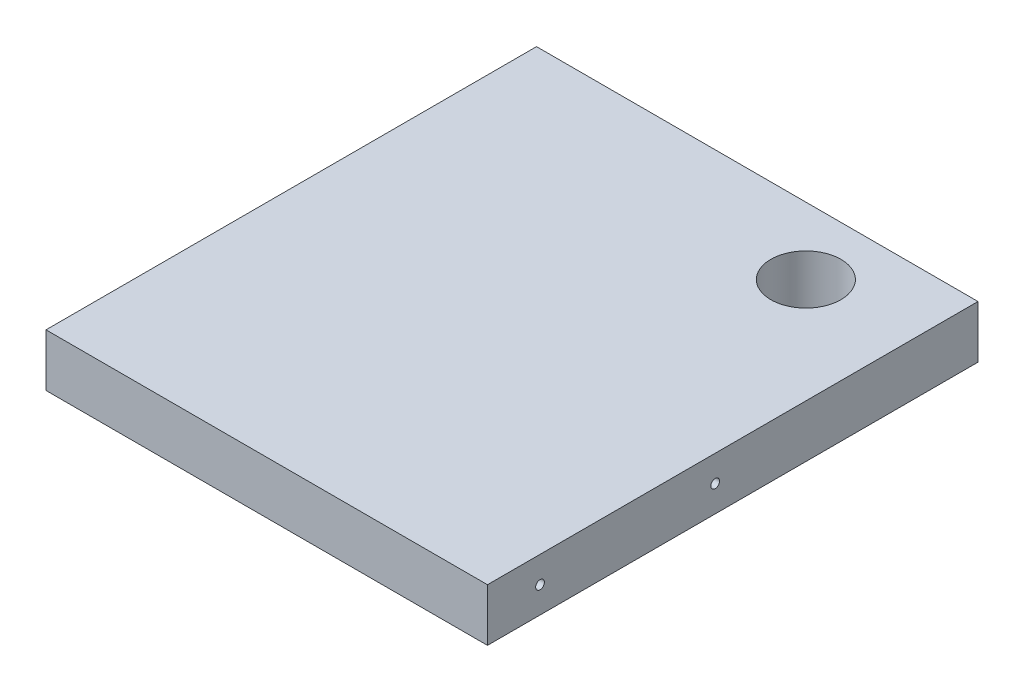
ISO-10303-21;
HEADER;
FILE_DESCRIPTION(('STEP AP214'),'2;1');
FILE_NAME('part.step','',(''),(''),'','','');
FILE_SCHEMA(('AUTOMOTIVE_DESIGN { 1 0 10303 214 1 1 1 1 }'));
ENDSEC;
DATA;
#1=APPLICATION_CONTEXT('core data for automotive mechanical design processes');
#2=APPLICATION_PROTOCOL_DEFINITION('international standard','automotive_design',2000,#1);
#3=PRODUCT_CONTEXT('',#1,'mechanical');
#4=PRODUCT('Part','Part','',(#3));
#5=PRODUCT_RELATED_PRODUCT_CATEGORY('part','',(#4));
#6=PRODUCT_DEFINITION_FORMATION('','',#4);
#7=PRODUCT_DEFINITION_CONTEXT('part definition',#1,'design');
#8=PRODUCT_DEFINITION('design','',#6,#7);
#9=PRODUCT_DEFINITION_SHAPE('','',#8);
#10=(LENGTH_UNIT() NAMED_UNIT(*) SI_UNIT(.MILLI.,.METRE.));
#11=(NAMED_UNIT(*) PLANE_ANGLE_UNIT() SI_UNIT($,.RADIAN.));
#12=(NAMED_UNIT(*) SI_UNIT($,.STERADIAN.) SOLID_ANGLE_UNIT());
#13=UNCERTAINTY_MEASURE_WITH_UNIT(LENGTH_MEASURE(1.E-05),#10,'distance_accuracy_value','');
#14=(GEOMETRIC_REPRESENTATION_CONTEXT(3) GLOBAL_UNCERTAINTY_ASSIGNED_CONTEXT((#13)) GLOBAL_UNIT_ASSIGNED_CONTEXT((#10,
#11,#12)) REPRESENTATION_CONTEXT('',''));
#15=CARTESIAN_POINT('',(0.,0.,0.));
#16=DIRECTION('',(0.,0.,1.));
#17=DIRECTION('',(1.,0.,0.));
#18=AXIS2_PLACEMENT_3D('',#15,#16,#17);
#19=CARTESIAN_POINT('',(0.,0.,0.));
#20=DIRECTION('',(0.,0.,1.));
#21=DIRECTION('',(1.,0.,0.));
#22=AXIS2_PLACEMENT_3D('',#19,#20,#21);
#23=PLANE('',#22);
#24=CARTESIAN_POINT('',(0.,5836.57938054568,0.));
#25=DIRECTION('',(0.,0.,1.));
#26=DIRECTION('',(1.,0.,0.));
#27=AXIS2_PLACEMENT_3D('',#24,#25,#26);
#28=CIRCLE('',#27,0.991870000000001);
#29=CARTESIAN_POINT('',(0.991870000000015,5836.57938054568,0.));
#30=VERTEX_POINT('',#29);
#31=EDGE_CURVE('E125',#30,#30,#28,.T.);
#32=ORIENTED_EDGE('',*,*,#31,.T.);
#33=EDGE_LOOP('',(#32));
#34=FACE_BOUND('',#33,.T.);
#35=CARTESIAN_POINT('',(60.9599999999995,5836.57938054568,0.));
#36=DIRECTION('',(0.,0.,1.));
#37=DIRECTION('',(1.,0.,0.));
#38=AXIS2_PLACEMENT_3D('',#35,#36,#37);
#39=CIRCLE('',#38,0.991870000000002);
#40=CARTESIAN_POINT('',(61.9518699999995,5836.57938054568,0.));
#41=VERTEX_POINT('',#40);
#42=EDGE_CURVE('E129',#41,#41,#39,.T.);
#43=ORIENTED_EDGE('',*,*,#42,.T.);
#44=EDGE_LOOP('',(#43));
#45=FACE_BOUND('',#44,.T.);
#46=CARTESIAN_POINT('',(-60.9599999999995,5836.57938054568,0.));
#47=DIRECTION('',(0.,0.,1.));
#48=DIRECTION('',(1.,0.,0.));
#49=AXIS2_PLACEMENT_3D('',#46,#47,#48);
#50=CIRCLE('',#49,0.991870000000002);
#51=CARTESIAN_POINT('',(-59.9681299999995,5836.57938054568,0.));
#52=VERTEX_POINT('',#51);
#53=EDGE_CURVE('E133',#52,#52,#50,.T.);
#54=ORIENTED_EDGE('',*,*,#53,.T.);
#55=EDGE_LOOP('',(#54));
#56=FACE_BOUND('',#55,.T.);
#57=DIRECTION('',(0.,-1.,0.));
#58=VECTOR('',#57,1.);
#59=CARTESIAN_POINT('',(-80.0099999999995,5846.10438054568,0.));
#60=LINE('',#59,#58);
#61=CARTESIAN_POINT('',(-80.0099999999995,5846.10438054568,0.));
#62=VERTEX_POINT('',#61);
#63=CARTESIAN_POINT('',(-80.0099999999995,5827.05438054568,0.));
#64=VERTEX_POINT('',#63);
#65=EDGE_CURVE('E138',#62,#64,#60,.T.);
#66=ORIENTED_EDGE('',*,*,#65,.F.);
#67=DIRECTION('',(-1.,0.,0.));
#68=VECTOR('',#67,1.);
#69=CARTESIAN_POINT('',(-80.0099999999995,5846.10438054568,0.));
#70=LINE('',#69,#68);
#71=CARTESIAN_POINT('',(80.0099999999995,5846.10438054568,0.));
#72=VERTEX_POINT('',#71);
#73=EDGE_CURVE('E147',#72,#62,#70,.T.);
#74=ORIENTED_EDGE('',*,*,#73,.F.);
#75=DIRECTION('',(0.,1.,0.));
#76=VECTOR('',#75,1.);
#77=CARTESIAN_POINT('',(80.0099999999995,5846.10438054568,0.));
#78=LINE('',#77,#76);
#79=CARTESIAN_POINT('',(80.0099999999995,5827.05438054568,0.));
#80=VERTEX_POINT('',#79);
#81=EDGE_CURVE('E144',#80,#72,#78,.T.);
#82=ORIENTED_EDGE('',*,*,#81,.F.);
#83=DIRECTION('',(1.,0.,0.));
#84=VECTOR('',#83,1.);
#85=CARTESIAN_POINT('',(-80.0099999999995,5827.05438054568,0.));
#86=LINE('',#85,#84);
#87=EDGE_CURVE('E141',#64,#80,#86,.T.);
#88=ORIENTED_EDGE('',*,*,#87,.F.);
#89=EDGE_LOOP('',(#66,#74,#82,#88));
#90=FACE_BOUND('',#89,.T.);
#91=ADVANCED_FACE('F33',(#34,#45,#56,#90),#23,.F.);
#92=CARTESIAN_POINT('',(-80.0099999999995,5846.10438054568,440.54993918708));
#93=DIRECTION('',(0.,-1.,0.));
#94=DIRECTION('',(0.,0.,-1.));
#95=AXIS2_PLACEMENT_3D('',#92,#93,#94);
#96=PLANE('',#95);
#97=CARTESIAN_POINT('',(41.9099999999995,5846.10438054568,24.2951604274264));
#98=DIRECTION('',(0.,-1.,0.));
#99=DIRECTION('',(0.,0.,-1.));
#100=AXIS2_PLACEMENT_3D('',#97,#98,#99);
#101=CIRCLE('',#100,12.7);
#102=CARTESIAN_POINT('',(41.9099999999995,5846.10438054568,11.5951604274264));
#103=VERTEX_POINT('',#102);
#104=EDGE_CURVE('E102',#103,#103,#101,.T.);
#105=ORIENTED_EDGE('',*,*,#104,.T.);
#106=EDGE_LOOP('',(#105));
#107=FACE_BOUND('',#106,.T.);
#108=DIRECTION('',(0.,0.,-1.));
#109=VECTOR('',#108,1.);
#110=CARTESIAN_POINT('',(-80.0099999999995,5846.10438054568,440.54993918708));
#111=LINE('',#110,#109);
#112=CARTESIAN_POINT('',(-80.0099999999995,5846.10438054568,177.799999999999));
#113=VERTEX_POINT('',#112);
#114=EDGE_CURVE('E150',#113,#62,#111,.T.);
#115=ORIENTED_EDGE('',*,*,#114,.F.);
#116=DIRECTION('',(1.,0.,0.));
#117=VECTOR('',#116,1.);
#118=CARTESIAN_POINT('',(-80.0100000000001,5846.10438054568,177.799999999999));
#119=LINE('',#118,#117);
#120=CARTESIAN_POINT('',(80.0099999999995,5846.10438054568,177.799999999999));
#121=VERTEX_POINT('',#120);
#122=EDGE_CURVE('E54',#113,#121,#119,.T.);
#123=ORIENTED_EDGE('',*,*,#122,.T.);
#124=DIRECTION('',(0.,0.,-1.));
#125=VECTOR('',#124,1.);
#126=CARTESIAN_POINT('',(80.0099999999995,5846.10438054568,440.54993918708));
#127=LINE('',#126,#125);
#128=EDGE_CURVE('E152',#121,#72,#127,.T.);
#129=ORIENTED_EDGE('',*,*,#128,.T.);
#130=ORIENTED_EDGE('',*,*,#73,.T.);
#131=EDGE_LOOP('',(#115,#123,#129,#130));
#132=FACE_BOUND('',#131,.T.);
#133=ADVANCED_FACE('F190',(#107,#132),#96,.F.);
#134=CARTESIAN_POINT('',(80.0099999999995,5846.10438054568,440.54993918708));
#135=DIRECTION('',(-1.,0.,0.));
#136=DIRECTION('',(0.,-1.,0.));
#137=AXIS2_PLACEMENT_3D('',#134,#135,#136);
#138=PLANE('',#137);
#139=CARTESIAN_POINT('',(80.0099999999995,5836.57938054568,158.749999999999));
#140=DIRECTION('',(-1.,0.,0.));
#141=DIRECTION('',(0.,-1.,0.));
#142=AXIS2_PLACEMENT_3D('',#139,#140,#141);
#143=CIRCLE('',#142,1.5875000000003);
#144=CARTESIAN_POINT('',(80.0099999999995,5834.99188054568,158.749999999999));
#145=VERTEX_POINT('',#144);
#146=EDGE_CURVE('E117',#145,#145,#143,.T.);
#147=ORIENTED_EDGE('',*,*,#146,.T.);
#148=EDGE_LOOP('',(#147));
#149=FACE_BOUND('',#148,.T.);
#150=CARTESIAN_POINT('',(80.0099999999995,5836.57938054568,95.2500000000001));
#151=DIRECTION('',(-1.,0.,0.));
#152=DIRECTION('',(0.,-1.,0.));
#153=AXIS2_PLACEMENT_3D('',#150,#151,#152);
#154=CIRCLE('',#153,1.5875000000003);
#155=CARTESIAN_POINT('',(80.0099999999995,5834.99188054568,95.2500000000001));
#156=VERTEX_POINT('',#155);
#157=EDGE_CURVE('E121',#156,#156,#154,.T.);
#158=ORIENTED_EDGE('',*,*,#157,.T.);
#159=EDGE_LOOP('',(#158));
#160=FACE_BOUND('',#159,.T.);
#161=ORIENTED_EDGE('',*,*,#128,.F.);
#162=DIRECTION('',(0.,-1.,0.));
#163=VECTOR('',#162,1.);
#164=CARTESIAN_POINT('',(80.0099999999995,5846.10438054568,177.799999999999));
#165=LINE('',#164,#163);
#166=CARTESIAN_POINT('',(80.0099999999995,5827.05438054568,177.799999999999));
#167=VERTEX_POINT('',#166);
#168=EDGE_CURVE('E134',#121,#167,#165,.T.);
#169=ORIENTED_EDGE('',*,*,#168,.T.);
#170=DIRECTION('',(0.,0.,-1.));
#171=VECTOR('',#170,1.);
#172=CARTESIAN_POINT('',(80.0099999999995,5827.05438054568,440.54993918708));
#173=LINE('',#172,#171);
#174=EDGE_CURVE('E154',#167,#80,#173,.T.);
#175=ORIENTED_EDGE('',*,*,#174,.T.);
#176=ORIENTED_EDGE('',*,*,#81,.T.);
#177=EDGE_LOOP('',(#161,#169,#175,#176));
#178=FACE_BOUND('',#177,.T.);
#179=ADVANCED_FACE('F196',(#149,#160,#178),#138,.F.);
#180=CARTESIAN_POINT('',(-80.0099999999995,5827.05438054568,440.54993918708));
#181=DIRECTION('',(0.,1.,0.));
#182=DIRECTION('',(0.,0.,1.));
#183=AXIS2_PLACEMENT_3D('',#180,#181,#182);
#184=PLANE('',#183);
#185=CARTESIAN_POINT('',(41.9099999999995,5827.05438054568,24.2951604274264));
#186=DIRECTION('',(0.,-1.,0.));
#187=DIRECTION('',(0.,0.,-1.));
#188=AXIS2_PLACEMENT_3D('',#185,#186,#187);
#189=CIRCLE('',#188,12.7);
#190=CARTESIAN_POINT('',(41.9099999999995,5827.05438054568,11.5951604274264));
#191=VERTEX_POINT('',#190);
#192=EDGE_CURVE('E107',#191,#191,#189,.T.);
#193=ORIENTED_EDGE('',*,*,#192,.F.);
#194=EDGE_LOOP('',(#193));
#195=FACE_BOUND('',#194,.T.);
#196=ORIENTED_EDGE('',*,*,#174,.F.);
#197=DIRECTION('',(-1.,0.,0.));
#198=VECTOR('',#197,1.);
#199=CARTESIAN_POINT('',(-80.0100000000001,5827.05438054568,177.799999999999));
#200=LINE('',#199,#198);
#201=CARTESIAN_POINT('',(-80.0099999999995,5827.05438054568,177.799999999999));
#202=VERTEX_POINT('',#201);
#203=EDGE_CURVE('E42',#167,#202,#200,.T.);
#204=ORIENTED_EDGE('',*,*,#203,.T.);
#205=DIRECTION('',(0.,0.,-1.));
#206=VECTOR('',#205,1.);
#207=CARTESIAN_POINT('',(-80.0099999999995,5827.05438054568,440.54993918708));
#208=LINE('',#207,#206);
#209=EDGE_CURVE('E156',#202,#64,#208,.T.);
#210=ORIENTED_EDGE('',*,*,#209,.T.);
#211=ORIENTED_EDGE('',*,*,#87,.T.);
#212=EDGE_LOOP('',(#196,#204,#210,#211));
#213=FACE_BOUND('',#212,.T.);
#214=ADVANCED_FACE('F205',(#195,#213),#184,.F.);
#215=CARTESIAN_POINT('',(-80.0099999999995,5846.10438054568,440.54993918708));
#216=DIRECTION('',(1.,0.,0.));
#217=DIRECTION('',(0.,1.,0.));
#218=AXIS2_PLACEMENT_3D('',#215,#216,#217);
#219=PLANE('',#218);
#220=CARTESIAN_POINT('',(-80.0099999999995,5836.57938054568,158.749999999999));
#221=DIRECTION('',(1.,0.,0.));
#222=DIRECTION('',(0.,1.,0.));
#223=AXIS2_PLACEMENT_3D('',#220,#221,#222);
#224=CIRCLE('',#223,1.5875000000003);
#225=CARTESIAN_POINT('',(-80.0099999999995,5838.16688054568,158.749999999999));
#226=VERTEX_POINT('',#225);
#227=EDGE_CURVE('E37',#226,#226,#224,.T.);
#228=ORIENTED_EDGE('',*,*,#227,.T.);
#229=EDGE_LOOP('',(#228));
#230=FACE_BOUND('',#229,.T.);
#231=CARTESIAN_POINT('',(-80.0099999999995,5836.57938054568,95.2500000000001));
#232=DIRECTION('',(1.,0.,0.));
#233=DIRECTION('',(0.,1.,0.));
#234=AXIS2_PLACEMENT_3D('',#231,#232,#233);
#235=CIRCLE('',#234,1.5875000000003);
#236=CARTESIAN_POINT('',(-80.0099999999995,5838.16688054568,95.2500000000001));
#237=VERTEX_POINT('',#236);
#238=EDGE_CURVE('E113',#237,#237,#235,.T.);
#239=ORIENTED_EDGE('',*,*,#238,.T.);
#240=EDGE_LOOP('',(#239));
#241=FACE_BOUND('',#240,.T.);
#242=ORIENTED_EDGE('',*,*,#209,.F.);
#243=DIRECTION('',(0.,1.,0.));
#244=VECTOR('',#243,1.);
#245=CARTESIAN_POINT('',(-80.0099999999995,5846.10438054568,177.799999999999));
#246=LINE('',#245,#244);
#247=EDGE_CURVE('E11',#202,#113,#246,.T.);
#248=ORIENTED_EDGE('',*,*,#247,.T.);
#249=ORIENTED_EDGE('',*,*,#114,.T.);
#250=ORIENTED_EDGE('',*,*,#65,.T.);
#251=EDGE_LOOP('',(#242,#248,#249,#250));
#252=FACE_BOUND('',#251,.T.);
#253=ADVANCED_FACE('F35',(#230,#241,#252),#219,.F.);
#254=CARTESIAN_POINT('',(-205.739999999999,5565.14000007211,177.8));
#255=DIRECTION('',(0.,0.,-1.));
#256=DIRECTION('',(1.,0.,0.));
#257=AXIS2_PLACEMENT_3D('',#254,#255,#256);
#258=PLANE('',#257);
#259=ORIENTED_EDGE('',*,*,#203,.F.);
#260=ORIENTED_EDGE('',*,*,#168,.F.);
#261=ORIENTED_EDGE('',*,*,#122,.F.);
#262=ORIENTED_EDGE('',*,*,#247,.F.);
#263=EDGE_LOOP('',(#259,#260,#261,#262));
#264=FACE_BOUND('',#263,.T.);
#265=ADVANCED_FACE('F201',(#264),#258,.F.);
#266=CARTESIAN_POINT('',(-60.9599999999995,5836.57938054568,-19.05));
#267=DIRECTION('',(0.,0.,-1.));
#268=DIRECTION('',(-1.,0.,0.));
#269=AXIS2_PLACEMENT_3D('',#266,#267,#268);
#270=CYLINDRICAL_SURFACE('',#269,0.991870000000002);
#271=CARTESIAN_POINT('',(-60.9599999999995,5836.57938054568,12.7));
#272=DIRECTION('',(0.,0.,-1.));
#273=DIRECTION('',(-1.,0.,0.));
#274=AXIS2_PLACEMENT_3D('',#271,#272,#273);
#275=CIRCLE('',#274,0.991869999999999);
#276=CARTESIAN_POINT('',(-61.9518699999995,5836.57938054568,12.7));
#277=VERTEX_POINT('',#276);
#278=EDGE_CURVE('E130',#277,#277,#275,.T.);
#279=ORIENTED_EDGE('',*,*,#278,.F.);
#280=EDGE_LOOP('',(#279));
#281=FACE_BOUND('',#280,.T.);
#282=ORIENTED_EDGE('',*,*,#53,.F.);
#283=EDGE_LOOP('',(#282));
#284=FACE_BOUND('',#283,.T.);
#285=ADVANCED_FACE('F221',(#281,#284),#270,.F.);
#286=CARTESIAN_POINT('',(-60.9599999999995,5836.57938054568,12.7));
#287=DIRECTION('',(0.,0.,-1.));
#288=DIRECTION('',(-1.,0.,0.));
#289=AXIS2_PLACEMENT_3D('',#286,#287,#288);
#290=CONICAL_SURFACE('',#289,0.991869999999999,1.02974425867666);
#291=CARTESIAN_POINT('',(-60.9599999999995,5836.57938054568,13.2959756221949));
#292=VERTEX_POINT('',#291);
#293=VERTEX_LOOP('',#292);
#294=FACE_BOUND('',#293,.T.);
#295=ORIENTED_EDGE('',*,*,#278,.T.);
#296=EDGE_LOOP('',(#295));
#297=FACE_BOUND('',#296,.T.);
#298=ADVANCED_FACE('F225',(#294,#297),#290,.F.);
#299=CARTESIAN_POINT('',(60.9599999999995,5836.57938054568,-19.05));
#300=DIRECTION('',(0.,0.,-1.));
#301=DIRECTION('',(-1.,0.,0.));
#302=AXIS2_PLACEMENT_3D('',#299,#300,#301);
#303=CYLINDRICAL_SURFACE('',#302,0.991870000000002);
#304=CARTESIAN_POINT('',(60.9599999999995,5836.57938054568,12.7));
#305=DIRECTION('',(0.,0.,-1.));
#306=DIRECTION('',(-1.,0.,0.));
#307=AXIS2_PLACEMENT_3D('',#304,#305,#306);
#308=CIRCLE('',#307,0.991869999999999);
#309=CARTESIAN_POINT('',(59.9681299999995,5836.57938054568,12.7));
#310=VERTEX_POINT('',#309);
#311=EDGE_CURVE('E126',#310,#310,#308,.T.);
#312=ORIENTED_EDGE('',*,*,#311,.F.);
#313=EDGE_LOOP('',(#312));
#314=FACE_BOUND('',#313,.T.);
#315=ORIENTED_EDGE('',*,*,#42,.F.);
#316=EDGE_LOOP('',(#315));
#317=FACE_BOUND('',#316,.T.);
#318=ADVANCED_FACE('F231',(#314,#317),#303,.F.);
#319=CARTESIAN_POINT('',(60.9599999999995,5836.57938054568,12.7));
#320=DIRECTION('',(0.,0.,-1.));
#321=DIRECTION('',(-1.,0.,0.));
#322=AXIS2_PLACEMENT_3D('',#319,#320,#321);
#323=CONICAL_SURFACE('',#322,0.991869999999999,1.02974425867666);
#324=CARTESIAN_POINT('',(60.9599999999995,5836.57938054568,13.2959756221949));
#325=VERTEX_POINT('',#324);
#326=VERTEX_LOOP('',#325);
#327=FACE_BOUND('',#326,.T.);
#328=ORIENTED_EDGE('',*,*,#311,.T.);
#329=EDGE_LOOP('',(#328));
#330=FACE_BOUND('',#329,.T.);
#331=ADVANCED_FACE('F236',(#327,#330),#323,.F.);
#332=CARTESIAN_POINT('',(0.,5836.57938054568,-19.05));
#333=DIRECTION('',(0.,0.,-1.));
#334=DIRECTION('',(-1.,0.,0.));
#335=AXIS2_PLACEMENT_3D('',#332,#333,#334);
#336=CYLINDRICAL_SURFACE('',#335,0.991870000000001);
#337=CARTESIAN_POINT('',(0.,5836.57938054568,12.7));
#338=DIRECTION('',(0.,0.,-1.));
#339=DIRECTION('',(-1.,0.,0.));
#340=AXIS2_PLACEMENT_3D('',#337,#338,#339);
#341=CIRCLE('',#340,0.99187);
#342=CARTESIAN_POINT('',(-0.991869999999986,5836.57938054568,12.7));
#343=VERTEX_POINT('',#342);
#344=EDGE_CURVE('E122',#343,#343,#341,.T.);
#345=ORIENTED_EDGE('',*,*,#344,.F.);
#346=EDGE_LOOP('',(#345));
#347=FACE_BOUND('',#346,.T.);
#348=ORIENTED_EDGE('',*,*,#31,.F.);
#349=EDGE_LOOP('',(#348));
#350=FACE_BOUND('',#349,.T.);
#351=ADVANCED_FACE('F239',(#347,#350),#336,.F.);
#352=CARTESIAN_POINT('',(0.,5836.57938054568,12.7));
#353=DIRECTION('',(0.,0.,-1.));
#354=DIRECTION('',(-1.,0.,0.));
#355=AXIS2_PLACEMENT_3D('',#352,#353,#354);
#356=CONICAL_SURFACE('',#355,0.99187,1.02974425867666);
#357=CARTESIAN_POINT('',(0.,5836.57938054568,13.2959756221949));
#358=VERTEX_POINT('',#357);
#359=VERTEX_LOOP('',#358);
#360=FACE_BOUND('',#359,.T.);
#361=ORIENTED_EDGE('',*,*,#344,.T.);
#362=EDGE_LOOP('',(#361));
#363=FACE_BOUND('',#362,.T.);
#364=ADVANCED_FACE('F244',(#360,#363),#356,.F.);
#365=CARTESIAN_POINT('',(99.06,5836.57938054568,95.2500000000001));
#366=DIRECTION('',(1.,0.,0.));
#367=DIRECTION('',(0.,0.,-1.));
#368=AXIS2_PLACEMENT_3D('',#365,#366,#367);
#369=CYLINDRICAL_SURFACE('',#368,1.5875000000003);
#370=CARTESIAN_POINT('',(67.31,5836.57938054568,95.2500000000001));
#371=DIRECTION('',(1.,0.,0.));
#372=DIRECTION('',(0.,0.,-1.));
#373=AXIS2_PLACEMENT_3D('',#370,#371,#372);
#374=CIRCLE('',#373,1.5875000000003);
#375=CARTESIAN_POINT('',(67.31,5836.57938054568,93.6624999999998));
#376=VERTEX_POINT('',#375);
#377=EDGE_CURVE('E118',#376,#376,#374,.T.);
#378=ORIENTED_EDGE('',*,*,#377,.F.);
#379=EDGE_LOOP('',(#378));
#380=FACE_BOUND('',#379,.T.);
#381=ORIENTED_EDGE('',*,*,#157,.F.);
#382=EDGE_LOOP('',(#381));
#383=FACE_BOUND('',#382,.T.);
#384=ADVANCED_FACE('F247',(#380,#383),#369,.F.);
#385=CARTESIAN_POINT('',(67.31,5836.57938054568,95.2500000000001));
#386=DIRECTION('',(1.,0.,0.));
#387=DIRECTION('',(0.,0.,-1.));
#388=AXIS2_PLACEMENT_3D('',#385,#386,#387);
#389=CONICAL_SURFACE('',#388,1.5875000000003,1.02974425867674);
#390=CARTESIAN_POINT('',(66.3561337672937,5836.57938054568,95.2500000000001));
#391=VERTEX_POINT('',#390);
#392=VERTEX_LOOP('',#391);
#393=FACE_BOUND('',#392,.T.);
#394=ORIENTED_EDGE('',*,*,#377,.T.);
#395=EDGE_LOOP('',(#394));
#396=FACE_BOUND('',#395,.T.);
#397=ADVANCED_FACE('F252',(#393,#396),#389,.F.);
#398=CARTESIAN_POINT('',(99.06,5836.57938054568,158.749999999999));
#399=DIRECTION('',(1.,0.,0.));
#400=DIRECTION('',(0.,0.,-1.));
#401=AXIS2_PLACEMENT_3D('',#398,#399,#400);
#402=CYLINDRICAL_SURFACE('',#401,1.5875000000003);
#403=CARTESIAN_POINT('',(67.31,5836.57938054568,158.749999999999));
#404=DIRECTION('',(1.,0.,0.));
#405=DIRECTION('',(0.,0.,-1.));
#406=AXIS2_PLACEMENT_3D('',#403,#404,#405);
#407=CIRCLE('',#406,1.5875000000003);
#408=CARTESIAN_POINT('',(67.31,5836.57938054568,157.162499999999));
#409=VERTEX_POINT('',#408);
#410=EDGE_CURVE('E114',#409,#409,#407,.T.);
#411=ORIENTED_EDGE('',*,*,#410,.F.);
#412=EDGE_LOOP('',(#411));
#413=FACE_BOUND('',#412,.T.);
#414=ORIENTED_EDGE('',*,*,#146,.F.);
#415=EDGE_LOOP('',(#414));
#416=FACE_BOUND('',#415,.T.);
#417=ADVANCED_FACE('F185',(#413,#416),#402,.F.);
#418=CARTESIAN_POINT('',(67.31,5836.57938054568,158.749999999999));
#419=DIRECTION('',(1.,0.,0.));
#420=DIRECTION('',(0.,0.,-1.));
#421=AXIS2_PLACEMENT_3D('',#418,#419,#420);
#422=CONICAL_SURFACE('',#421,1.5875000000003,1.02974425867674);
#423=CARTESIAN_POINT('',(66.3561337672937,5836.57938054568,158.749999999999));
#424=VERTEX_POINT('',#423);
#425=VERTEX_LOOP('',#424);
#426=FACE_BOUND('',#425,.T.);
#427=ORIENTED_EDGE('',*,*,#410,.T.);
#428=EDGE_LOOP('',(#427));
#429=FACE_BOUND('',#428,.T.);
#430=ADVANCED_FACE('F176',(#426,#429),#422,.F.);
#431=CARTESIAN_POINT('',(-99.06,5836.57938054568,95.2500000000001));
#432=DIRECTION('',(-1.,0.,0.));
#433=DIRECTION('',(0.,0.,1.));
#434=AXIS2_PLACEMENT_3D('',#431,#432,#433);
#435=CYLINDRICAL_SURFACE('',#434,1.5875000000003);
#436=CARTESIAN_POINT('',(-67.31,5836.57938054568,95.2500000000001));
#437=DIRECTION('',(-1.,0.,0.));
#438=DIRECTION('',(0.,0.,1.));
#439=AXIS2_PLACEMENT_3D('',#436,#437,#438);
#440=CIRCLE('',#439,1.5875000000003);
#441=CARTESIAN_POINT('',(-67.31,5836.57938054568,96.8375000000003));
#442=VERTEX_POINT('',#441);
#443=EDGE_CURVE('E105',#442,#442,#440,.T.);
#444=ORIENTED_EDGE('',*,*,#443,.F.);
#445=EDGE_LOOP('',(#444));
#446=FACE_BOUND('',#445,.T.);
#447=ORIENTED_EDGE('',*,*,#238,.F.);
#448=EDGE_LOOP('',(#447));
#449=FACE_BOUND('',#448,.T.);
#450=ADVANCED_FACE('F173',(#446,#449),#435,.F.);
#451=CARTESIAN_POINT('',(-67.31,5836.57938054568,95.2500000000001));
#452=DIRECTION('',(-1.,0.,0.));
#453=DIRECTION('',(0.,0.,1.));
#454=AXIS2_PLACEMENT_3D('',#451,#452,#453);
#455=CONICAL_SURFACE('',#454,1.5875000000003,1.02974425867671);
#456=CARTESIAN_POINT('',(-66.3561337672937,5836.57938054568,95.2500000000001));
#457=VERTEX_POINT('',#456);
#458=VERTEX_LOOP('',#457);
#459=FACE_BOUND('',#458,.T.);
#460=ORIENTED_EDGE('',*,*,#443,.T.);
#461=EDGE_LOOP('',(#460));
#462=FACE_BOUND('',#461,.T.);
#463=ADVANCED_FACE('F175',(#459,#462),#455,.F.);
#464=CARTESIAN_POINT('',(-99.06,5836.57938054568,158.749999999999));
#465=DIRECTION('',(-1.,0.,0.));
#466=DIRECTION('',(0.,0.,1.));
#467=AXIS2_PLACEMENT_3D('',#464,#465,#466);
#468=CYLINDRICAL_SURFACE('',#467,1.5875000000003);
#469=CARTESIAN_POINT('',(-67.31,5836.57938054568,158.749999999999));
#470=DIRECTION('',(-1.,0.,0.));
#471=DIRECTION('',(0.,0.,1.));
#472=AXIS2_PLACEMENT_3D('',#469,#470,#471);
#473=CIRCLE('',#472,1.5875000000003);
#474=CARTESIAN_POINT('',(-67.31,5836.57938054568,160.3375));
#475=VERTEX_POINT('',#474);
#476=EDGE_CURVE('E100',#475,#475,#473,.T.);
#477=ORIENTED_EDGE('',*,*,#476,.F.);
#478=EDGE_LOOP('',(#477));
#479=FACE_BOUND('',#478,.T.);
#480=ORIENTED_EDGE('',*,*,#227,.F.);
#481=EDGE_LOOP('',(#480));
#482=FACE_BOUND('',#481,.T.);
#483=ADVANCED_FACE('F96',(#479,#482),#468,.F.);
#484=CARTESIAN_POINT('',(-67.31,5836.57938054568,158.749999999999));
#485=DIRECTION('',(-1.,0.,0.));
#486=DIRECTION('',(0.,0.,1.));
#487=AXIS2_PLACEMENT_3D('',#484,#485,#486);
#488=CONICAL_SURFACE('',#487,1.5875000000003,1.02974425867672);
#489=CARTESIAN_POINT('',(-66.3561337672938,5836.57938054568,158.749999999999));
#490=VERTEX_POINT('',#489);
#491=VERTEX_LOOP('',#490);
#492=FACE_BOUND('',#491,.T.);
#493=ORIENTED_EDGE('',*,*,#476,.T.);
#494=EDGE_LOOP('',(#493));
#495=FACE_BOUND('',#494,.T.);
#496=ADVANCED_FACE('F92',(#492,#495),#488,.F.);
#497=CARTESIAN_POINT('',(41.9099999999995,5827.05438054568,24.2951604274264));
#498=DIRECTION('',(0.,-1.,0.));
#499=DIRECTION('',(0.,0.,-1.));
#500=AXIS2_PLACEMENT_3D('',#497,#498,#499);
#501=CYLINDRICAL_SURFACE('',#500,12.7);
#502=ORIENTED_EDGE('',*,*,#104,.F.);
#503=EDGE_LOOP('',(#502));
#504=FACE_BOUND('',#503,.T.);
#505=ORIENTED_EDGE('',*,*,#192,.T.);
#506=EDGE_LOOP('',(#505));
#507=FACE_BOUND('',#506,.T.);
#508=ADVANCED_FACE('F95',(#504,#507),#501,.F.);
#509=CLOSED_SHELL('',(#91,#133,#179,#214,#253,#265,#285,#298,#318,#331,#351,#364,#384,#397,#417,
#430,#450,#463,#483,#496,#508));
#510=MANIFOLD_SOLID_BREP('B2',#509);
#511=ADVANCED_BREP_SHAPE_REPRESENTATION('',(#18,#510),#14);
#512=SHAPE_DEFINITION_REPRESENTATION(#9,#511);
ENDSEC;
END-ISO-10303-21;
